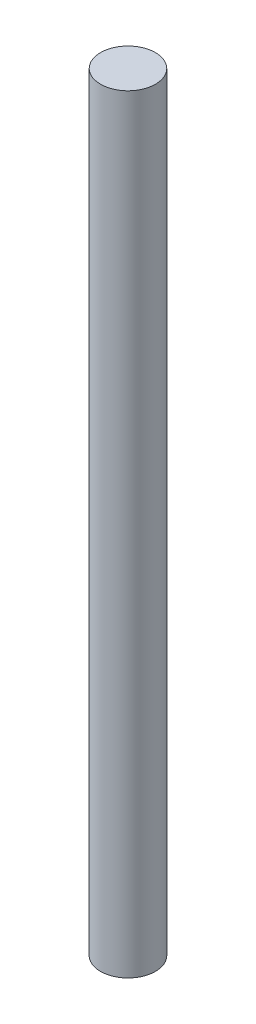
ISO-10303-21;
HEADER;
FILE_DESCRIPTION(('STEP AP214'),'2;1');
FILE_NAME('part.step','',(''),(''),'','','');
FILE_SCHEMA(('AUTOMOTIVE_DESIGN { 1 0 10303 214 1 1 1 1 }'));
ENDSEC;
DATA;
#1=APPLICATION_CONTEXT('core data for automotive mechanical design processes');
#2=APPLICATION_PROTOCOL_DEFINITION('international standard','automotive_design',2000,#1);
#3=PRODUCT_CONTEXT('',#1,'mechanical');
#4=PRODUCT('Part','Part','',(#3));
#5=PRODUCT_RELATED_PRODUCT_CATEGORY('part','',(#4));
#6=PRODUCT_DEFINITION_FORMATION('','',#4);
#7=PRODUCT_DEFINITION_CONTEXT('part definition',#1,'design');
#8=PRODUCT_DEFINITION('design','',#6,#7);
#9=PRODUCT_DEFINITION_SHAPE('','',#8);
#10=(LENGTH_UNIT() NAMED_UNIT(*) SI_UNIT(.MILLI.,.METRE.));
#11=(NAMED_UNIT(*) PLANE_ANGLE_UNIT() SI_UNIT($,.RADIAN.));
#12=(NAMED_UNIT(*) SI_UNIT($,.STERADIAN.) SOLID_ANGLE_UNIT());
#13=UNCERTAINTY_MEASURE_WITH_UNIT(LENGTH_MEASURE(1.E-05),#10,'distance_accuracy_value','');
#14=(GEOMETRIC_REPRESENTATION_CONTEXT(3) GLOBAL_UNCERTAINTY_ASSIGNED_CONTEXT((#13)) GLOBAL_UNIT_ASSIGNED_CONTEXT((#10,
#11,#12)) REPRESENTATION_CONTEXT('',''));
#15=CARTESIAN_POINT('',(0.,0.,0.));
#16=DIRECTION('',(0.,0.,1.));
#17=DIRECTION('',(1.,0.,0.));
#18=AXIS2_PLACEMENT_3D('',#15,#16,#17);
#19=CARTESIAN_POINT('',(0.,140.,0.));
#20=DIRECTION('',(0.,-1.,0.));
#21=DIRECTION('',(0.,0.,-1.));
#22=AXIS2_PLACEMENT_3D('',#19,#20,#21);
#23=CYLINDRICAL_SURFACE('',#22,5.);
#24=CARTESIAN_POINT('',(0.,140.,0.));
#25=DIRECTION('',(0.,1.,0.));
#26=DIRECTION('',(0.,0.,1.));
#27=AXIS2_PLACEMENT_3D('',#24,#25,#26);
#28=CIRCLE('',#27,5.);
#29=CARTESIAN_POINT('',(0.,140.,5.));
#30=VERTEX_POINT('',#29);
#31=EDGE_CURVE('E10',#30,#30,#28,.T.);
#32=ORIENTED_EDGE('',*,*,#31,.F.);
#33=EDGE_LOOP('',(#32));
#34=FACE_BOUND('',#33,.T.);
#35=CARTESIAN_POINT('',(0.,0.,0.));
#36=DIRECTION('',(0.,1.,0.));
#37=DIRECTION('',(0.,0.,1.));
#38=AXIS2_PLACEMENT_3D('',#35,#36,#37);
#39=CIRCLE('',#38,5.);
#40=CARTESIAN_POINT('',(0.,0.,5.));
#41=VERTEX_POINT('',#40);
#42=EDGE_CURVE('E34',#41,#41,#39,.T.);
#43=ORIENTED_EDGE('',*,*,#42,.T.);
#44=EDGE_LOOP('',(#43));
#45=FACE_BOUND('',#44,.T.);
#46=ADVANCED_FACE('F31',(#34,#45),#23,.T.);
#47=CARTESIAN_POINT('',(0.,140.,0.));
#48=DIRECTION('',(0.,1.,0.));
#49=DIRECTION('',(0.,0.,1.));
#50=AXIS2_PLACEMENT_3D('',#47,#48,#49);
#51=PLANE('',#50);
#52=ORIENTED_EDGE('',*,*,#31,.T.);
#53=EDGE_LOOP('',(#52));
#54=FACE_BOUND('',#53,.T.);
#55=ADVANCED_FACE('F46',(#54),#51,.T.);
#56=CARTESIAN_POINT('',(0.,0.,0.));
#57=DIRECTION('',(0.,1.,0.));
#58=DIRECTION('',(0.,0.,1.));
#59=AXIS2_PLACEMENT_3D('',#56,#57,#58);
#60=PLANE('',#59);
#61=ORIENTED_EDGE('',*,*,#42,.F.);
#62=EDGE_LOOP('',(#61));
#63=FACE_BOUND('',#62,.T.);
#64=ADVANCED_FACE('F44',(#63),#60,.F.);
#65=CLOSED_SHELL('',(#46,#55,#64));
#66=MANIFOLD_SOLID_BREP('B2',#65);
#67=ADVANCED_BREP_SHAPE_REPRESENTATION('',(#18,#66),#14);
#68=SHAPE_DEFINITION_REPRESENTATION(#9,#67);
ENDSEC;
END-ISO-10303-21;
